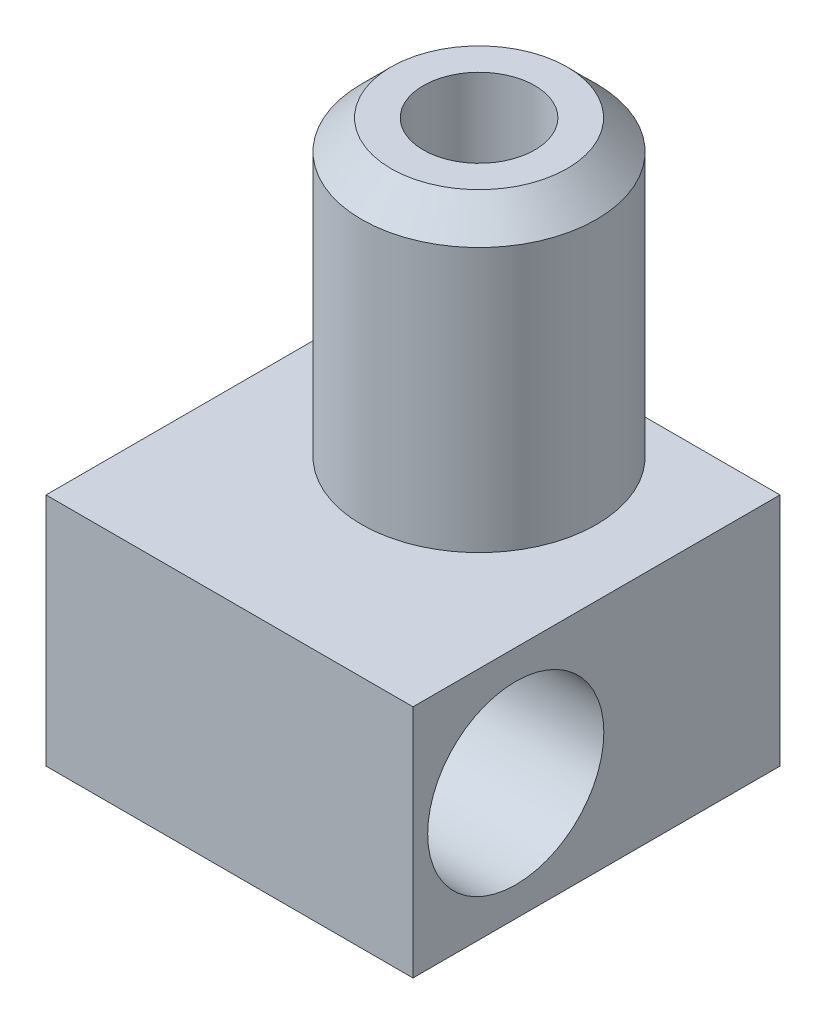
ISO-10303-21;
HEADER;
FILE_DESCRIPTION(('STEP AP214'),'2;1');
FILE_NAME('part.step','',(''),(''),'','','');
FILE_SCHEMA(('AUTOMOTIVE_DESIGN { 1 0 10303 214 1 1 1 1 }'));
ENDSEC;
DATA;
#1=APPLICATION_CONTEXT('core data for automotive mechanical design processes');
#2=APPLICATION_PROTOCOL_DEFINITION('international standard','automotive_design',2000,#1);
#3=PRODUCT_CONTEXT('',#1,'mechanical');
#4=PRODUCT('Part','Part','',(#3));
#5=PRODUCT_RELATED_PRODUCT_CATEGORY('part','',(#4));
#6=PRODUCT_DEFINITION_FORMATION('','',#4);
#7=PRODUCT_DEFINITION_CONTEXT('part definition',#1,'design');
#8=PRODUCT_DEFINITION('design','',#6,#7);
#9=PRODUCT_DEFINITION_SHAPE('','',#8);
#10=(LENGTH_UNIT() NAMED_UNIT(*) SI_UNIT(.MILLI.,.METRE.));
#11=(NAMED_UNIT(*) PLANE_ANGLE_UNIT() SI_UNIT($,.RADIAN.));
#12=(NAMED_UNIT(*) SI_UNIT($,.STERADIAN.) SOLID_ANGLE_UNIT());
#13=UNCERTAINTY_MEASURE_WITH_UNIT(LENGTH_MEASURE(1.E-05),#10,'distance_accuracy_value','');
#14=(GEOMETRIC_REPRESENTATION_CONTEXT(3) GLOBAL_UNCERTAINTY_ASSIGNED_CONTEXT((#13)) GLOBAL_UNIT_ASSIGNED_CONTEXT((#10,
#11,#12)) REPRESENTATION_CONTEXT('',''));
#15=CARTESIAN_POINT('',(0.,0.,0.));
#16=DIRECTION('',(0.,0.,1.));
#17=DIRECTION('',(1.,0.,0.));
#18=AXIS2_PLACEMENT_3D('',#15,#16,#17);
#19=CARTESIAN_POINT('',(0.,8.,0.));
#20=DIRECTION('',(0.,-1.,0.));
#21=DIRECTION('',(0.,0.,-1.));
#22=AXIS2_PLACEMENT_3D('',#19,#20,#21);
#23=PLANE('',#22);
#24=DIRECTION('',(-1.,0.,0.));
#25=VECTOR('',#24,1.);
#26=CARTESIAN_POINT('',(-6.25,8.,-4.));
#27=LINE('',#26,#25);
#28=CARTESIAN_POINT('',(6.25,8.,-4.));
#29=VERTEX_POINT('',#28);
#30=CARTESIAN_POINT('',(0.,8.,-4.));
#31=VERTEX_POINT('',#30);
#32=EDGE_CURVE('E89',#29,#31,#27,.T.);
#33=ORIENTED_EDGE('',*,*,#32,.T.);
#34=CARTESIAN_POINT('',(0.,8.,0.));
#35=DIRECTION('',(0.,1.,0.));
#36=DIRECTION('',(0.,0.,1.));
#37=AXIS2_PLACEMENT_3D('',#34,#35,#36);
#38=CIRCLE('',#37,4.);
#39=EDGE_CURVE('E91',#31,#31,#38,.T.);
#40=ORIENTED_EDGE('',*,*,#39,.F.);
#41=CARTESIAN_POINT('',(-6.25,8.,-4.));
#42=VERTEX_POINT('',#41);
#43=EDGE_CURVE('E59',#31,#42,#27,.T.);
#44=ORIENTED_EDGE('',*,*,#43,.T.);
#45=DIRECTION('',(0.,0.,1.));
#46=VECTOR('',#45,1.);
#47=CARTESIAN_POINT('',(-6.25,8.,8.5));
#48=LINE('',#47,#46);
#49=CARTESIAN_POINT('',(-6.25,8.,8.5));
#50=VERTEX_POINT('',#49);
#51=EDGE_CURVE('E111',#42,#50,#48,.T.);
#52=ORIENTED_EDGE('',*,*,#51,.T.);
#53=DIRECTION('',(1.,0.,0.));
#54=VECTOR('',#53,1.);
#55=CARTESIAN_POINT('',(-6.25,8.,8.5));
#56=LINE('',#55,#54);
#57=CARTESIAN_POINT('',(6.25,8.,8.5));
#58=VERTEX_POINT('',#57);
#59=EDGE_CURVE('E85',#50,#58,#56,.T.);
#60=ORIENTED_EDGE('',*,*,#59,.T.);
#61=DIRECTION('',(0.,0.,-1.));
#62=VECTOR('',#61,1.);
#63=CARTESIAN_POINT('',(6.25,8.,8.5));
#64=LINE('',#63,#62);
#65=EDGE_CURVE('E93',#58,#29,#64,.T.);
#66=ORIENTED_EDGE('',*,*,#65,.T.);
#67=EDGE_LOOP('',(#33,#40,#44,#52,#60,#66));
#68=FACE_BOUND('',#67,.T.);
#69=ADVANCED_FACE('F34',(#68),#23,.F.);
#70=CARTESIAN_POINT('',(0.,-26.5281717356203,0.));
#71=DIRECTION('',(0.,-1.,0.));
#72=DIRECTION('',(0.,0.,-1.));
#73=AXIS2_PLACEMENT_3D('',#70,#71,#72);
#74=CYLINDRICAL_SURFACE('',#73,0.150000000000001);
#75=CARTESIAN_POINT('',(0.,1.94849391670177,0.));
#76=DIRECTION('',(0.,1.,0.));
#77=DIRECTION('',(0.,0.,1.));
#78=AXIS2_PLACEMENT_3D('',#75,#76,#77);
#79=CIRCLE('',#78,0.150000000000001);
#80=CARTESIAN_POINT('',(0.,1.94849391670177,0.150000000000001));
#81=VERTEX_POINT('',#80);
#82=EDGE_CURVE('E38',#81,#81,#79,.T.);
#83=ORIENTED_EDGE('',*,*,#82,.T.);
#84=EDGE_LOOP('',(#83));
#85=FACE_BOUND('',#84,.T.);
#86=CARTESIAN_POINT('',(0.,-3.,0.));
#87=DIRECTION('',(0.,-1.,0.));
#88=DIRECTION('',(0.,0.,-1.));
#89=AXIS2_PLACEMENT_3D('',#86,#87,#88);
#90=CIRCLE('',#89,0.150000000000001);
#91=CARTESIAN_POINT('',(0.,-3.,-0.150000000000001));
#92=VERTEX_POINT('',#91);
#93=EDGE_CURVE('E129',#92,#92,#90,.T.);
#94=ORIENTED_EDGE('',*,*,#93,.T.);
#95=EDGE_LOOP('',(#94));
#96=FACE_BOUND('',#95,.T.);
#97=ADVANCED_FACE('F152',(#85,#96),#74,.F.);
#98=CARTESIAN_POINT('',(-0.150000000000001,-3.,0.));
#99=DIRECTION('',(0.,1.,0.));
#100=DIRECTION('',(0.,0.,1.));
#101=AXIS2_PLACEMENT_3D('',#98,#99,#100);
#102=PLANE('',#101);
#103=ORIENTED_EDGE('',*,*,#93,.F.);
#104=EDGE_LOOP('',(#103));
#105=FACE_BOUND('',#104,.T.);
#106=CARTESIAN_POINT('',(0.,-3.,0.));
#107=DIRECTION('',(0.,-1.,0.));
#108=DIRECTION('',(0.,0.,-1.));
#109=AXIS2_PLACEMENT_3D('',#106,#107,#108);
#110=CIRCLE('',#109,0.5);
#111=CARTESIAN_POINT('',(0.,-3.,0.5));
#112=VERTEX_POINT('',#111);
#113=EDGE_CURVE('E126',#112,#112,#110,.T.);
#114=ORIENTED_EDGE('',*,*,#113,.T.);
#115=EDGE_LOOP('',(#114));
#116=FACE_BOUND('',#115,.T.);
#117=ADVANCED_FACE('F157',(#105,#116),#102,.F.);
#118=CARTESIAN_POINT('',(0.,-1.,0.));
#119=DIRECTION('',(0.,1.,0.));
#120=DIRECTION('',(0.,0.,1.));
#121=AXIS2_PLACEMENT_3D('',#118,#119,#120);
#122=CONICAL_SURFACE('',#121,4.,1.05165021254837);
#123=CARTESIAN_POINT('',(0.,-1.,0.));
#124=DIRECTION('',(0.,-1.,0.));
#125=DIRECTION('',(0.,0.,-1.));
#126=AXIS2_PLACEMENT_3D('',#123,#124,#125);
#127=CIRCLE('',#126,4.);
#128=CARTESIAN_POINT('',(0.,-1.,4.));
#129=VERTEX_POINT('',#128);
#130=EDGE_CURVE('E123',#129,#129,#127,.T.);
#131=CARTESIAN_POINT('',(0.,-3.,0.5));
#132=CARTESIAN_POINT('',(0.,-2.97916666666667,0.536458333333334));
#133=CARTESIAN_POINT('',(0.,-2.95833333333333,0.572916666666667));
#134=CARTESIAN_POINT('',(0.,-2.91666666666667,0.645833333333333));
#135=CARTESIAN_POINT('',(0.,-2.89583333333333,0.682291666666666));
#136=CARTESIAN_POINT('',(0.,-2.85416666666667,0.755208333333333));
#137=CARTESIAN_POINT('',(0.,-2.83333333333333,0.791666666666667));
#138=CARTESIAN_POINT('',(0.,-2.79166666666667,0.864583333333333));
#139=CARTESIAN_POINT('',(0.,-2.77083333333333,0.901041666666667));
#140=CARTESIAN_POINT('',(0.,-2.72916666666667,0.973958333333333));
#141=CARTESIAN_POINT('',(0.,-2.70833333333333,1.01041666666667));
#142=CARTESIAN_POINT('',(0.,-2.66666666666667,1.08333333333333));
#143=CARTESIAN_POINT('',(0.,-2.64583333333333,1.11979166666667));
#144=CARTESIAN_POINT('',(0.,-2.60416666666667,1.19270833333333));
#145=CARTESIAN_POINT('',(0.,-2.58333333333333,1.22916666666667));
#146=CARTESIAN_POINT('',(0.,-2.54166666666667,1.30208333333333));
#147=CARTESIAN_POINT('',(0.,-2.52083333333333,1.33854166666667));
#148=CARTESIAN_POINT('',(0.,-2.47916666666667,1.41145833333333));
#149=CARTESIAN_POINT('',(0.,-2.45833333333333,1.44791666666667));
#150=CARTESIAN_POINT('',(0.,-2.41666666666667,1.52083333333333));
#151=CARTESIAN_POINT('',(0.,-2.39583333333333,1.55729166666667));
#152=CARTESIAN_POINT('',(0.,-2.35416666666667,1.63020833333333));
#153=CARTESIAN_POINT('',(0.,-2.33333333333333,1.66666666666667));
#154=CARTESIAN_POINT('',(0.,-2.29166666666667,1.73958333333333));
#155=CARTESIAN_POINT('',(0.,-2.27083333333333,1.77604166666667));
#156=CARTESIAN_POINT('',(0.,-2.22916666666667,1.84895833333333));
#157=CARTESIAN_POINT('',(0.,-2.20833333333333,1.88541666666667));
#158=CARTESIAN_POINT('',(0.,-2.16666666666667,1.95833333333333));
#159=CARTESIAN_POINT('',(0.,-2.14583333333333,1.99479166666667));
#160=CARTESIAN_POINT('',(0.,-2.10416666666667,2.06770833333333));
#161=CARTESIAN_POINT('',(0.,-2.08333333333333,2.10416666666667));
#162=CARTESIAN_POINT('',(0.,-2.04166666666667,2.17708333333333));
#163=CARTESIAN_POINT('',(0.,-2.02083333333333,2.21354166666667));
#164=CARTESIAN_POINT('',(0.,-1.97916666666667,2.28645833333333));
#165=CARTESIAN_POINT('',(0.,-1.95833333333333,2.32291666666667));
#166=CARTESIAN_POINT('',(0.,-1.91666666666667,2.39583333333333));
#167=CARTESIAN_POINT('',(0.,-1.89583333333333,2.43229166666667));
#168=CARTESIAN_POINT('',(0.,-1.85416666666667,2.50520833333333));
#169=CARTESIAN_POINT('',(0.,-1.83333333333333,2.54166666666667));
#170=CARTESIAN_POINT('',(0.,-1.79166666666667,2.61458333333333));
#171=CARTESIAN_POINT('',(0.,-1.77083333333333,2.65104166666667));
#172=CARTESIAN_POINT('',(0.,-1.72916666666667,2.72395833333333));
#173=CARTESIAN_POINT('',(0.,-1.70833333333333,2.76041666666667));
#174=CARTESIAN_POINT('',(0.,-1.66666666666667,2.83333333333333));
#175=CARTESIAN_POINT('',(0.,-1.64583333333333,2.86979166666667));
#176=CARTESIAN_POINT('',(0.,-1.60416666666667,2.94270833333333));
#177=CARTESIAN_POINT('',(0.,-1.58333333333333,2.97916666666667));
#178=CARTESIAN_POINT('',(0.,-1.54166666666667,3.05208333333333));
#179=CARTESIAN_POINT('',(0.,-1.52083333333333,3.08854166666667));
#180=CARTESIAN_POINT('',(0.,-1.47916666666667,3.16145833333333));
#181=CARTESIAN_POINT('',(0.,-1.45833333333333,3.19791666666667));
#182=CARTESIAN_POINT('',(0.,-1.41666666666667,3.27083333333333));
#183=CARTESIAN_POINT('',(0.,-1.39583333333333,3.30729166666667));
#184=CARTESIAN_POINT('',(0.,-1.35416666666667,3.38020833333333));
#185=CARTESIAN_POINT('',(0.,-1.33333333333333,3.41666666666667));
#186=CARTESIAN_POINT('',(0.,-1.29166666666667,3.48958333333333));
#187=CARTESIAN_POINT('',(0.,-1.27083333333333,3.52604166666667));
#188=CARTESIAN_POINT('',(0.,-1.22916666666667,3.59895833333333));
#189=CARTESIAN_POINT('',(0.,-1.20833333333333,3.63541666666667));
#190=CARTESIAN_POINT('',(0.,-1.16666666666667,3.70833333333333));
#191=CARTESIAN_POINT('',(0.,-1.14583333333333,3.74479166666667));
#192=CARTESIAN_POINT('',(0.,-1.10416666666667,3.81770833333333));
#193=CARTESIAN_POINT('',(0.,-1.08333333333333,3.85416666666667));
#194=CARTESIAN_POINT('',(0.,-1.04166666666667,3.92708333333333));
#195=CARTESIAN_POINT('',(0.,-1.02083333333333,3.96354166666667));
#196=CARTESIAN_POINT('',(0.,-1.,4.));
#197=B_SPLINE_CURVE_WITH_KNOTS('',3,(#131,#132,#133,#134,#135,#136,#137,#138,#139,#140,#141,
#142,#143,#144,#145,#146,#147,#148,#149,#150,#151,#152,#153,#154,#155,#156,#157,#158,#159,#160,
#161,#162,#163,#164,#165,#166,#167,#168,#169,#170,#171,#172,#173,#174,#175,#176,#177,#178,#179,
#180,#181,#182,#183,#184,#185,#186,#187,#188,#189,#190,#191,#192,#193,#194,#195,#196),
.UNSPECIFIED.,.F.,.F.,(4,2,2,2,2,2,2,2,2,2,2,2,2,2,2,2,2,2,2,2,2,2,2,2,2,2,2,2,2,2,2,2,4),(0.,
0.125972777317165,0.251945554634329,0.377918331951494,0.503891109268659,0.629863886585824,
0.755836663902989,0.881809441220154,1.00778221853732,1.13375499585448,1.25972777317165,
1.38570055048881,1.51167332780598,1.63764610512314,1.76361888244031,1.88959165975747,
2.01556443707464,2.1415372143918,2.26750999170897,2.39348276902613,2.5194555463433,
2.64542832366046,2.77140110097763,2.89737387829479,3.02334665561196,3.14931943292912,
3.27529221024628,3.40126498756345,3.52723776488061,3.65321054219778,3.77918331951494,
3.90515609683211,4.03112887414927),.UNSPECIFIED.);
#198=EDGE_CURVE('BSEAM184',#112,#129,#197,.T.);
#199=ORIENTED_EDGE('',*,*,#113,.F.);
#200=ORIENTED_EDGE('',*,*,#130,.T.);
#201=ORIENTED_EDGE('',*,*,#198,.T.);
#202=ORIENTED_EDGE('',*,*,#198,.F.);
#203=EDGE_LOOP('',(#199,#201,#200,#202));
#204=FACE_BOUND('',#203,.T.);
#205=ADVANCED_FACE('F184',(#204),#122,.T.);
#206=CARTESIAN_POINT('',(0.,-26.5281717356203,0.));
#207=DIRECTION('',(0.,-1.,0.));
#208=DIRECTION('',(0.,0.,-1.));
#209=AXIS2_PLACEMENT_3D('',#206,#207,#208);
#210=CYLINDRICAL_SURFACE('',#209,4.);
#211=ORIENTED_EDGE('',*,*,#130,.F.);
#212=EDGE_LOOP('',(#211));
#213=FACE_BOUND('',#212,.T.);
#214=CARTESIAN_POINT('',(0.,0.,0.));
#215=DIRECTION('',(0.,-1.,0.));
#216=DIRECTION('',(0.,0.,-1.));
#217=AXIS2_PLACEMENT_3D('',#214,#215,#216);
#218=CIRCLE('',#217,4.);
#219=CARTESIAN_POINT('',(0.,0.,-4.));
#220=VERTEX_POINT('',#219);
#221=EDGE_CURVE('E120',#220,#220,#218,.T.);
#222=ORIENTED_EDGE('',*,*,#221,.T.);
#223=EDGE_LOOP('',(#222));
#224=FACE_BOUND('',#223,.T.);
#225=ADVANCED_FACE('F167',(#213,#224),#210,.T.);
#226=CARTESIAN_POINT('',(0.,0.,0.));
#227=DIRECTION('',(0.,-1.,0.));
#228=DIRECTION('',(0.,0.,-1.));
#229=AXIS2_PLACEMENT_3D('',#226,#227,#228);
#230=PLANE('',#229);
#231=DIRECTION('',(-1.,0.,0.));
#232=VECTOR('',#231,1.);
#233=CARTESIAN_POINT('',(-6.25,0.,-4.));
#234=LINE('',#233,#232);
#235=CARTESIAN_POINT('',(-6.25,0.,-4.));
#236=VERTEX_POINT('',#235);
#237=EDGE_CURVE('E77',#220,#236,#234,.T.);
#238=ORIENTED_EDGE('',*,*,#237,.F.);
#239=ORIENTED_EDGE('',*,*,#221,.F.);
#240=CARTESIAN_POINT('',(6.25,0.,-4.));
#241=VERTEX_POINT('',#240);
#242=EDGE_CURVE('E50',#241,#220,#234,.T.);
#243=ORIENTED_EDGE('',*,*,#242,.F.);
#244=DIRECTION('',(0.,0.,-1.));
#245=VECTOR('',#244,1.);
#246=CARTESIAN_POINT('',(6.25,0.,8.5));
#247=LINE('',#246,#245);
#248=CARTESIAN_POINT('',(6.25,0.,8.5));
#249=VERTEX_POINT('',#248);
#250=EDGE_CURVE('E108',#249,#241,#247,.T.);
#251=ORIENTED_EDGE('',*,*,#250,.F.);
#252=DIRECTION('',(1.,0.,0.));
#253=VECTOR('',#252,1.);
#254=CARTESIAN_POINT('',(-6.25,0.,8.5));
#255=LINE('',#254,#253);
#256=CARTESIAN_POINT('',(-6.25,0.,8.5));
#257=VERTEX_POINT('',#256);
#258=EDGE_CURVE('E105',#257,#249,#255,.T.);
#259=ORIENTED_EDGE('',*,*,#258,.F.);
#260=DIRECTION('',(0.,0.,1.));
#261=VECTOR('',#260,1.);
#262=CARTESIAN_POINT('',(-6.25,0.,8.5));
#263=LINE('',#262,#261);
#264=EDGE_CURVE('E102',#236,#257,#263,.T.);
#265=ORIENTED_EDGE('',*,*,#264,.F.);
#266=EDGE_LOOP('',(#238,#239,#243,#251,#259,#265));
#267=FACE_BOUND('',#266,.T.);
#268=ADVANCED_FACE('F163',(#267),#230,.T.);
#269=CARTESIAN_POINT('',(-6.25,8.,8.5));
#270=DIRECTION('',(1.,0.,0.));
#271=DIRECTION('',(0.,0.,-1.));
#272=AXIS2_PLACEMENT_3D('',#269,#270,#271);
#273=PLANE('',#272);
#274=CARTESIAN_POINT('',(-6.25,4.,5.));
#275=DIRECTION('',(1.,0.,0.));
#276=DIRECTION('',(0.,0.,-1.));
#277=AXIS2_PLACEMENT_3D('',#274,#275,#276);
#278=CIRCLE('',#277,3.);
#279=CARTESIAN_POINT('',(-6.25,4.,2.));
#280=VERTEX_POINT('',#279);
#281=EDGE_CURVE('E106',#280,#280,#278,.T.);
#282=ORIENTED_EDGE('',*,*,#281,.T.);
#283=EDGE_LOOP('',(#282));
#284=FACE_BOUND('',#283,.T.);
#285=ORIENTED_EDGE('',*,*,#264,.T.);
#286=DIRECTION('',(0.,-1.,0.));
#287=VECTOR('',#286,1.);
#288=CARTESIAN_POINT('',(-6.25,8.,8.5));
#289=LINE('',#288,#287);
#290=EDGE_CURVE('E118',#50,#257,#289,.T.);
#291=ORIENTED_EDGE('',*,*,#290,.F.);
#292=ORIENTED_EDGE('',*,*,#51,.F.);
#293=DIRECTION('',(0.,-1.,0.));
#294=VECTOR('',#293,1.);
#295=CARTESIAN_POINT('',(-6.25,8.,-4.));
#296=LINE('',#295,#294);
#297=EDGE_CURVE('E95',#42,#236,#296,.T.);
#298=ORIENTED_EDGE('',*,*,#297,.T.);
#299=EDGE_LOOP('',(#285,#291,#292,#298));
#300=FACE_BOUND('',#299,.T.);
#301=ADVANCED_FACE('F166',(#284,#300),#273,.F.);
#302=CARTESIAN_POINT('',(-6.25,8.,8.5));
#303=DIRECTION('',(0.,0.,-1.));
#304=DIRECTION('',(-1.,0.,0.));
#305=AXIS2_PLACEMENT_3D('',#302,#303,#304);
#306=PLANE('',#305);
#307=ORIENTED_EDGE('',*,*,#258,.T.);
#308=DIRECTION('',(0.,-1.,0.));
#309=VECTOR('',#308,1.);
#310=CARTESIAN_POINT('',(6.25,8.,8.5));
#311=LINE('',#310,#309);
#312=EDGE_CURVE('E115',#58,#249,#311,.T.);
#313=ORIENTED_EDGE('',*,*,#312,.F.);
#314=ORIENTED_EDGE('',*,*,#59,.F.);
#315=ORIENTED_EDGE('',*,*,#290,.T.);
#316=EDGE_LOOP('',(#307,#313,#314,#315));
#317=FACE_BOUND('',#316,.T.);
#318=ADVANCED_FACE('F175',(#317),#306,.F.);
#319=CARTESIAN_POINT('',(6.25,8.,8.5));
#320=DIRECTION('',(-1.,0.,0.));
#321=DIRECTION('',(0.,0.,1.));
#322=AXIS2_PLACEMENT_3D('',#319,#320,#321);
#323=PLANE('',#322);
#324=CARTESIAN_POINT('',(6.25,4.,5.));
#325=DIRECTION('',(1.,0.,0.));
#326=DIRECTION('',(0.,0.,-1.));
#327=AXIS2_PLACEMENT_3D('',#324,#325,#326);
#328=CIRCLE('',#327,3.);
#329=CARTESIAN_POINT('',(6.25,4.,2.));
#330=VERTEX_POINT('',#329);
#331=EDGE_CURVE('E206',#330,#330,#328,.T.);
#332=ORIENTED_EDGE('',*,*,#331,.F.);
#333=EDGE_LOOP('',(#332));
#334=FACE_BOUND('',#333,.T.);
#335=ORIENTED_EDGE('',*,*,#250,.T.);
#336=DIRECTION('',(0.,-1.,0.));
#337=VECTOR('',#336,1.);
#338=CARTESIAN_POINT('',(6.25,8.,-4.));
#339=LINE('',#338,#337);
#340=EDGE_CURVE('E113',#29,#241,#339,.T.);
#341=ORIENTED_EDGE('',*,*,#340,.F.);
#342=ORIENTED_EDGE('',*,*,#65,.F.);
#343=ORIENTED_EDGE('',*,*,#312,.T.);
#344=EDGE_LOOP('',(#335,#341,#342,#343));
#345=FACE_BOUND('',#344,.T.);
#346=ADVANCED_FACE('F171',(#334,#345),#323,.F.);
#347=CARTESIAN_POINT('',(-6.25,8.,-4.));
#348=DIRECTION('',(0.,0.,1.));
#349=DIRECTION('',(1.,0.,0.));
#350=AXIS2_PLACEMENT_3D('',#347,#348,#349);
#351=PLANE('',#350);
#352=CARTESIAN_POINT('',(5.3,4.,-4.));
#353=DIRECTION('',(0.,0.,-1.));
#354=DIRECTION('',(-1.,0.,0.));
#355=AXIS2_PLACEMENT_3D('',#352,#353,#354);
#356=CIRCLE('',#355,0.750000000000001);
#357=CARTESIAN_POINT('',(4.55,4.,-4.));
#358=VERTEX_POINT('',#357);
#359=EDGE_CURVE('E212',#358,#358,#356,.T.);
#360=ORIENTED_EDGE('',*,*,#359,.F.);
#361=EDGE_LOOP('',(#360));
#362=FACE_BOUND('',#361,.T.);
#363=ORIENTED_EDGE('',*,*,#242,.T.);
#364=ORIENTED_EDGE('',*,*,#237,.T.);
#365=ORIENTED_EDGE('',*,*,#297,.F.);
#366=ORIENTED_EDGE('',*,*,#43,.F.);
#367=ORIENTED_EDGE('',*,*,#32,.F.);
#368=ORIENTED_EDGE('',*,*,#340,.T.);
#369=EDGE_LOOP('',(#363,#364,#365,#366,#367,#368));
#370=FACE_BOUND('',#369,.T.);
#371=ADVANCED_FACE('F97',(#362,#370),#351,.F.);
#372=CARTESIAN_POINT('',(-6.25,4.,5.));
#373=DIRECTION('',(1.,0.,0.));
#374=DIRECTION('',(0.,0.,-1.));
#375=AXIS2_PLACEMENT_3D('',#372,#373,#374);
#376=CYLINDRICAL_SURFACE('',#375,3.);
#377=ORIENTED_EDGE('',*,*,#281,.F.);
#378=EDGE_LOOP('',(#377));
#379=FACE_BOUND('',#378,.T.);
#380=ORIENTED_EDGE('',*,*,#331,.T.);
#381=EDGE_LOOP('',(#380));
#382=FACE_BOUND('',#381,.T.);
#383=ADVANCED_FACE('F161',(#379,#382),#376,.F.);
#384=CARTESIAN_POINT('',(5.3,4.,-0.500000000000002));
#385=DIRECTION('',(0.,0.,-1.));
#386=DIRECTION('',(-1.,0.,0.));
#387=AXIS2_PLACEMENT_3D('',#384,#385,#386);
#388=CYLINDRICAL_SURFACE('',#387,0.750000000000001);
#389=CARTESIAN_POINT('',(5.3,4.,-0.500000000000002));
#390=DIRECTION('',(0.,0.,-1.));
#391=DIRECTION('',(-1.,0.,0.));
#392=AXIS2_PLACEMENT_3D('',#389,#390,#391);
#393=CIRCLE('',#392,0.750000000000001);
#394=CARTESIAN_POINT('',(4.55,4.,-0.500000000000002));
#395=VERTEX_POINT('',#394);
#396=EDGE_CURVE('E209',#395,#395,#393,.T.);
#397=ORIENTED_EDGE('',*,*,#396,.F.);
#398=EDGE_LOOP('',(#397));
#399=FACE_BOUND('',#398,.T.);
#400=ORIENTED_EDGE('',*,*,#359,.T.);
#401=EDGE_LOOP('',(#400));
#402=FACE_BOUND('',#401,.T.);
#403=ADVANCED_FACE('F232',(#399,#402),#388,.F.);
#404=CARTESIAN_POINT('',(5.3,4.,-0.500000000000002));
#405=DIRECTION('',(0.,0.,-1.));
#406=DIRECTION('',(-1.,0.,0.));
#407=AXIS2_PLACEMENT_3D('',#404,#405,#406);
#408=PLANE('',#407);
#409=ORIENTED_EDGE('',*,*,#396,.T.);
#410=EDGE_LOOP('',(#409));
#411=FACE_BOUND('',#410,.T.);
#412=ADVANCED_FACE('F227',(#411),#408,.T.);
#413=CARTESIAN_POINT('',(0.,18.,0.));
#414=DIRECTION('',(0.,1.,0.));
#415=DIRECTION('',(0.,0.,1.));
#416=AXIS2_PLACEMENT_3D('',#413,#414,#415);
#417=PLANE('',#416);
#418=CARTESIAN_POINT('',(0.,18.,0.));
#419=DIRECTION('',(0.,1.,0.));
#420=DIRECTION('',(0.,0.,1.));
#421=AXIS2_PLACEMENT_3D('',#418,#419,#420);
#422=CIRCLE('',#421,1.9);
#423=CARTESIAN_POINT('',(0.,18.,1.9));
#424=VERTEX_POINT('',#423);
#425=EDGE_CURVE('E221',#424,#424,#422,.T.);
#426=ORIENTED_EDGE('',*,*,#425,.F.);
#427=EDGE_LOOP('',(#426));
#428=FACE_BOUND('',#427,.T.);
#429=CARTESIAN_POINT('',(0.,18.,0.));
#430=DIRECTION('',(0.,1.,0.));
#431=DIRECTION('',(0.,0.,1.));
#432=AXIS2_PLACEMENT_3D('',#429,#430,#431);
#433=CIRCLE('',#432,3.00000000000001);
#434=CARTESIAN_POINT('',(0.,18.,3.00000000000001));
#435=VERTEX_POINT('',#434);
#436=EDGE_CURVE('E43',#435,#435,#433,.T.);
#437=ORIENTED_EDGE('',*,*,#436,.T.);
#438=EDGE_LOOP('',(#437));
#439=FACE_BOUND('',#438,.T.);
#440=ADVANCED_FACE('F135',(#428,#439),#417,.T.);
#441=CARTESIAN_POINT('',(0.,18.,0.));
#442=DIRECTION('',(0.,-1.,0.));
#443=DIRECTION('',(0.,0.,-1.));
#444=AXIS2_PLACEMENT_3D('',#441,#442,#443);
#445=CYLINDRICAL_SURFACE('',#444,4.);
#446=CARTESIAN_POINT('',(0.,17.,0.));
#447=DIRECTION('',(0.,1.,0.));
#448=DIRECTION('',(0.,0.,1.));
#449=AXIS2_PLACEMENT_3D('',#446,#447,#448);
#450=CIRCLE('',#449,4.);
#451=CARTESIAN_POINT('',(0.,17.,4.));
#452=VERTEX_POINT('',#451);
#453=EDGE_CURVE('E11',#452,#452,#450,.F.);
#454=ORIENTED_EDGE('',*,*,#453,.T.);
#455=EDGE_LOOP('',(#454));
#456=FACE_BOUND('',#455,.T.);
#457=ORIENTED_EDGE('',*,*,#39,.T.);
#458=EDGE_LOOP('',(#457));
#459=FACE_BOUND('',#458,.T.);
#460=ADVANCED_FACE('F139',(#456,#459),#445,.T.);
#461=CARTESIAN_POINT('',(0.,18.,0.));
#462=DIRECTION('',(0.,-1.,0.));
#463=DIRECTION('',(0.,0.,-1.));
#464=AXIS2_PLACEMENT_3D('',#461,#462,#463);
#465=CONICAL_SURFACE('',#464,3.00000000000001,0.785398163397445);
#466=ORIENTED_EDGE('',*,*,#453,.F.);
#467=EDGE_LOOP('',(#466));
#468=FACE_BOUND('',#467,.T.);
#469=ORIENTED_EDGE('',*,*,#436,.F.);
#470=EDGE_LOOP('',(#469));
#471=FACE_BOUND('',#470,.T.);
#472=ADVANCED_FACE('F36',(#468,#471),#465,.T.);
#473=CARTESIAN_POINT('',(0.,3.,0.));
#474=DIRECTION('',(0.,1.,0.));
#475=DIRECTION('',(0.,0.,1.));
#476=AXIS2_PLACEMENT_3D('',#473,#474,#475);
#477=CONICAL_SURFACE('',#476,1.9,1.02974425867665);
#478=CARTESIAN_POINT('',(0.,3.,0.));
#479=DIRECTION('',(0.,1.,0.));
#480=DIRECTION('',(0.,0.,1.));
#481=AXIS2_PLACEMENT_3D('',#478,#479,#480);
#482=CIRCLE('',#481,1.9);
#483=CARTESIAN_POINT('',(0.,3.,1.9));
#484=VERTEX_POINT('',#483);
#485=EDGE_CURVE('E218',#484,#484,#482,.T.);
#486=CARTESIAN_POINT('',(0.,3.,1.9));
#487=CARTESIAN_POINT('',(0.,2.98904681163231,1.88177083333333));
#488=CARTESIAN_POINT('',(0.,2.97809362326462,1.86354166666666));
#489=CARTESIAN_POINT('',(0.,2.95618724652924,1.82708333333333));
#490=CARTESIAN_POINT('',(0.,2.94523405816155,1.80885416666666));
#491=CARTESIAN_POINT('',(0.,2.92332768142617,1.77239583333333));
#492=CARTESIAN_POINT('',(0.,2.91237449305848,1.75416666666666));
#493=CARTESIAN_POINT('',(0.,2.8904681163231,1.71770833333333));
#494=CARTESIAN_POINT('',(0.,2.87951492795541,1.69947916666666));
#495=CARTESIAN_POINT('',(0.,2.85760855122003,1.66302083333333));
#496=CARTESIAN_POINT('',(0.,2.84665536285234,1.64479166666666));
#497=CARTESIAN_POINT('',(0.,2.82474898611696,1.60833333333333));
#498=CARTESIAN_POINT('',(0.,2.81379579774927,1.59010416666666));
#499=CARTESIAN_POINT('',(0.,2.79188942101389,1.55364583333333));
#500=CARTESIAN_POINT('',(0.,2.7809362326462,1.53541666666666));
#501=CARTESIAN_POINT('',(0.,2.75902985591082,1.49895833333333));
#502=CARTESIAN_POINT('',(0.,2.74807666754313,1.48072916666666));
#503=CARTESIAN_POINT('',(0.,2.72617029080775,1.44427083333333));
#504=CARTESIAN_POINT('',(0.,2.71521710244006,1.42604166666666));
#505=CARTESIAN_POINT('',(0.,2.69331072570468,1.38958333333333));
#506=CARTESIAN_POINT('',(0.,2.68235753733699,1.37135416666666));
#507=CARTESIAN_POINT('',(0.,2.66045116060161,1.33489583333333));
#508=CARTESIAN_POINT('',(0.,2.64949797223392,1.31666666666666));
#509=CARTESIAN_POINT('',(0.,2.62759159549855,1.28020833333333));
#510=CARTESIAN_POINT('',(0.,2.61663840713086,1.26197916666666));
#511=CARTESIAN_POINT('',(0.,2.59473203039548,1.22552083333333));
#512=CARTESIAN_POINT('',(0.,2.58377884202779,1.20729166666666));
#513=CARTESIAN_POINT('',(0.,2.56187246529241,1.17083333333333));
#514=CARTESIAN_POINT('',(0.,2.55091927692472,1.15260416666666));
#515=CARTESIAN_POINT('',(0.,2.52901290018934,1.11614583333333));
#516=CARTESIAN_POINT('',(0.,2.51805971182165,1.09791666666666));
#517=CARTESIAN_POINT('',(0.,2.49615333508627,1.06145833333333));
#518=CARTESIAN_POINT('',(0.,2.48520014671858,1.04322916666666));
#519=CARTESIAN_POINT('',(0.,2.4632937699832,1.00677083333333));
#520=CARTESIAN_POINT('',(0.,2.45234058161551,0.988541666666665));
#521=CARTESIAN_POINT('',(0.,2.43043420488013,0.952083333333332));
#522=CARTESIAN_POINT('',(0.,2.41948101651244,0.933854166666665));
#523=CARTESIAN_POINT('',(0.,2.39757463977706,0.897395833333332));
#524=CARTESIAN_POINT('',(0.,2.38662145140937,0.879166666666665));
#525=CARTESIAN_POINT('',(0.,2.36471507467399,0.842708333333332));
#526=CARTESIAN_POINT('',(0.,2.3537618863063,0.824479166666666));
#527=CARTESIAN_POINT('',(0.,2.33185550957092,0.788020833333332));
#528=CARTESIAN_POINT('',(0.,2.32090232120323,0.769791666666666));
#529=CARTESIAN_POINT('',(0.,2.29899594446785,0.733333333333333));
#530=CARTESIAN_POINT('',(0.,2.28804275610016,0.715104166666666));
#531=CARTESIAN_POINT('',(0.,2.26613637936478,0.678645833333333));
#532=CARTESIAN_POINT('',(0.,2.25518319099709,0.660416666666666));
#533=CARTESIAN_POINT('',(0.,2.23327681426171,0.623958333333333));
#534=CARTESIAN_POINT('',(0.,2.22232362589402,0.605729166666666));
#535=CARTESIAN_POINT('',(0.,2.20041724915864,0.569270833333333));
#536=CARTESIAN_POINT('',(0.,2.18946406079095,0.551041666666666));
#537=CARTESIAN_POINT('',(0.,2.16755768405557,0.514583333333333));
#538=CARTESIAN_POINT('',(0.,2.15660449568788,0.496354166666667));
#539=CARTESIAN_POINT('',(0.,2.1346981189525,0.459895833333333));
#540=CARTESIAN_POINT('',(0.,2.12374493058481,0.441666666666667));
#541=CARTESIAN_POINT('',(0.,2.10183855384943,0.405208333333333));
#542=CARTESIAN_POINT('',(0.,2.09088536548174,0.386979166666667));
#543=CARTESIAN_POINT('',(0.,2.06897898874636,0.350520833333334));
#544=CARTESIAN_POINT('',(0.,2.05802580037867,0.332291666666667));
#545=CARTESIAN_POINT('',(0.,2.03611942364329,0.295833333333334));
#546=CARTESIAN_POINT('',(0.,2.0251662352756,0.277604166666667));
#547=CARTESIAN_POINT('',(0.,2.00325985854022,0.241145833333334));
#548=CARTESIAN_POINT('',(0.,1.99230667017253,0.222916666666667));
#549=CARTESIAN_POINT('',(0.,1.97040029343715,0.186458333333334));
#550=CARTESIAN_POINT('',(0.,1.95944710506946,0.168229166666667));
#551=CARTESIAN_POINT('',(0.,1.94849391670177,0.150000000000001));
#552=B_SPLINE_CURVE_WITH_KNOTS('',3,(#486,#487,#488,#489,#490,#491,#492,#493,#494,#495,#496,
#497,#498,#499,#500,#501,#502,#503,#504,#505,#506,#507,#508,#509,#510,#511,#512,#513,#514,#515,
#516,#517,#518,#519,#520,#521,#522,#523,#524,#525,#526,#527,#528,#529,#530,#531,#532,#533,#534,
#535,#536,#537,#538,#539,#540,#541,#542,#543,#544,#545,#546,#547,#548,#549,#550,#551),
.UNSPECIFIED.,.F.,.F.,(4,2,2,2,2,2,2,2,2,2,2,2,2,2,2,2,2,2,2,2,2,2,2,2,2,2,2,2,2,2,2,2,4),(0.,
0.0638002639102133,0.127600527820427,0.19140079173064,0.255201055640853,0.319001319551066,
0.38280158346128,0.446601847371493,0.510402111281706,0.57420237519192,0.638002639102133,
0.701802903012346,0.765603166922559,0.829403430832773,0.893203694742986,0.957003958653199,
1.02080422256341,1.08460448647363,1.14840475038384,1.21220501429405,1.27600527820427,
1.33980554211448,1.40360580602469,1.46740606993491,1.53120633384512,1.59500659775533,
1.65880686166554,1.72260712557576,1.78640738948597,1.85020765339618,1.9140079173064,
1.97780818121661,2.04160844512682),.UNSPECIFIED.);
#553=EDGE_CURVE('BSEAM138',#484,#81,#552,.T.);
#554=ORIENTED_EDGE('',*,*,#485,.T.);
#555=ORIENTED_EDGE('',*,*,#82,.F.);
#556=ORIENTED_EDGE('',*,*,#553,.T.);
#557=ORIENTED_EDGE('',*,*,#553,.F.);
#558=EDGE_LOOP('',(#554,#556,#555,#557));
#559=FACE_BOUND('',#558,.T.);
#560=ADVANCED_FACE('F138',(#559),#477,.F.);
#561=CARTESIAN_POINT('',(0.,18.,0.));
#562=DIRECTION('',(0.,1.,0.));
#563=DIRECTION('',(0.,0.,1.));
#564=AXIS2_PLACEMENT_3D('',#561,#562,#563);
#565=CYLINDRICAL_SURFACE('',#564,1.9);
#566=ORIENTED_EDGE('',*,*,#485,.F.);
#567=EDGE_LOOP('',(#566));
#568=FACE_BOUND('',#567,.T.);
#569=ORIENTED_EDGE('',*,*,#425,.T.);
#570=EDGE_LOOP('',(#569));
#571=FACE_BOUND('',#570,.T.);
#572=ADVANCED_FACE('F145',(#568,#571),#565,.F.);
#573=CLOSED_SHELL('',(#69,#97,#117,#205,#225,#268,#301,#318,#346,#371,#383,#403,#412,#440,#460,
#472,#560,#572));
#574=MANIFOLD_SOLID_BREP('B2',#573);
#575=ADVANCED_BREP_SHAPE_REPRESENTATION('',(#18,#574),#14);
#576=SHAPE_DEFINITION_REPRESENTATION(#9,#575);
ENDSEC;
END-ISO-10303-21;
